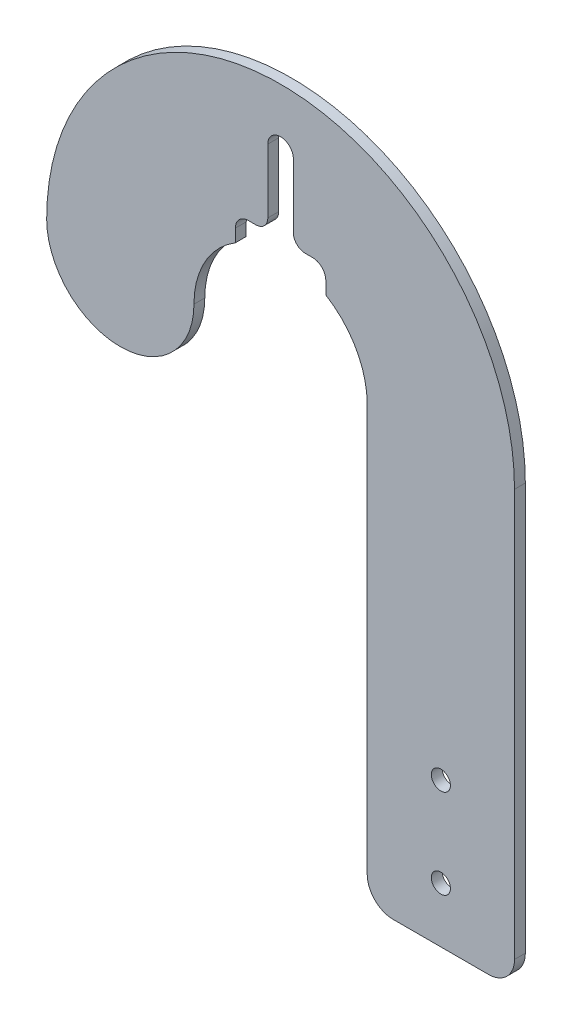
ISO-10303-21;
HEADER;
FILE_DESCRIPTION(('STEP AP214'),'2;1');
FILE_NAME('part.step','',(''),(''),'','','');
FILE_SCHEMA(('AUTOMOTIVE_DESIGN { 1 0 10303 214 1 1 1 1 }'));
ENDSEC;
DATA;
#1=APPLICATION_CONTEXT('core data for automotive mechanical design processes');
#2=APPLICATION_PROTOCOL_DEFINITION('international standard','automotive_design',2000,#1);
#3=PRODUCT_CONTEXT('',#1,'mechanical');
#4=PRODUCT('Part','Part','',(#3));
#5=PRODUCT_RELATED_PRODUCT_CATEGORY('part','',(#4));
#6=PRODUCT_DEFINITION_FORMATION('','',#4);
#7=PRODUCT_DEFINITION_CONTEXT('part definition',#1,'design');
#8=PRODUCT_DEFINITION('design','',#6,#7);
#9=PRODUCT_DEFINITION_SHAPE('','',#8);
#10=(LENGTH_UNIT() NAMED_UNIT(*) SI_UNIT(.MILLI.,.METRE.));
#11=(NAMED_UNIT(*) PLANE_ANGLE_UNIT() SI_UNIT($,.RADIAN.));
#12=(NAMED_UNIT(*) SI_UNIT($,.STERADIAN.) SOLID_ANGLE_UNIT());
#13=UNCERTAINTY_MEASURE_WITH_UNIT(LENGTH_MEASURE(1.E-05),#10,'distance_accuracy_value','');
#14=(GEOMETRIC_REPRESENTATION_CONTEXT(3) GLOBAL_UNCERTAINTY_ASSIGNED_CONTEXT((#13)) GLOBAL_UNIT_ASSIGNED_CONTEXT((#10,
#11,#12)) REPRESENTATION_CONTEXT('',''));
#15=CARTESIAN_POINT('',(0.,0.,0.));
#16=DIRECTION('',(0.,0.,1.));
#17=DIRECTION('',(1.,0.,0.));
#18=AXIS2_PLACEMENT_3D('',#15,#16,#17);
#19=CARTESIAN_POINT('',(-33.3556419332564,127.,-3.175));
#20=DIRECTION('',(0.,0.,-1.));
#21=DIRECTION('',(1.,0.,0.));
#22=AXIS2_PLACEMENT_3D('',#19,#20,#21);
#23=PLANE('',#22);
#24=CARTESIAN_POINT('',(13.6343580667436,16.2152888150637,-3.175));
#25=DIRECTION('',(0.,0.,1.));
#26=DIRECTION('',(1.,0.,0.));
#27=AXIS2_PLACEMENT_3D('',#24,#25,#26);
#28=CIRCLE('',#27,2.794);
#29=CARTESIAN_POINT('',(16.4283580667436,16.2152888150637,-3.175));
#30=VERTEX_POINT('',#29);
#31=EDGE_CURVE('E233',#30,#30,#28,.T.);
#32=ORIENTED_EDGE('',*,*,#31,.T.);
#33=EDGE_LOOP('',(#32));
#34=FACE_BOUND('',#33,.T.);
#35=CARTESIAN_POINT('',(13.6343580667436,42.3772888150637,-3.175));
#36=DIRECTION('',(0.,0.,1.));
#37=DIRECTION('',(1.,0.,0.));
#38=AXIS2_PLACEMENT_3D('',#35,#36,#37);
#39=CIRCLE('',#38,2.794);
#40=CARTESIAN_POINT('',(16.4283580667436,42.3772888150637,-3.175));
#41=VERTEX_POINT('',#40);
#42=EDGE_CURVE('E356',#41,#41,#39,.T.);
#43=ORIENTED_EDGE('',*,*,#42,.T.);
#44=EDGE_LOOP('',(#43));
#45=FACE_BOUND('',#44,.T.);
#46=DIRECTION('',(1.,0.,0.));
#47=VECTOR('',#46,1.);
#48=CARTESIAN_POINT('',(0.,156.225,-3.175));
#49=LINE('',#48,#47);
#50=CARTESIAN_POINT('',(-42.7806419332564,156.225,-3.175));
#51=VERTEX_POINT('',#50);
#52=CARTESIAN_POINT('',(-40.6056419332564,156.225,-3.175));
#53=VERTEX_POINT('',#52);
#54=EDGE_CURVE('E344',#51,#53,#49,.T.);
#55=ORIENTED_EDGE('',*,*,#54,.F.);
#56=CARTESIAN_POINT('',(-42.7806419332564,152.4,-3.175));
#57=DIRECTION('',(0.,0.,1.));
#58=DIRECTION('',(1.,0.,0.));
#59=AXIS2_PLACEMENT_3D('',#56,#57,#58);
#60=CIRCLE('',#59,3.825);
#61=CARTESIAN_POINT('',(-46.6056419332564,152.4,-3.175));
#62=VERTEX_POINT('',#61);
#63=EDGE_CURVE('E305',#62,#51,#60,.F.);
#64=ORIENTED_EDGE('',*,*,#63,.F.);
#65=DIRECTION('',(0.,1.,0.));
#66=VECTOR('',#65,1.);
#67=CARTESIAN_POINT('',(-46.6056419332564,0.,-3.175));
#68=LINE('',#67,#66);
#69=CARTESIAN_POINT('',(-46.6056419332564,148.670198430102,-3.175));
#70=VERTEX_POINT('',#69);
#71=EDGE_CURVE('E347',#70,#62,#68,.T.);
#72=ORIENTED_EDGE('',*,*,#71,.F.);
#73=CARTESIAN_POINT('',(-33.3556419332564,127.,-3.175));
#74=DIRECTION('',(0.,0.,-1.));
#75=DIRECTION('',(1.,0.,0.));
#76=AXIS2_PLACEMENT_3D('',#73,#74,#75);
#77=CIRCLE('',#76,25.4);
#78=CARTESIAN_POINT('',(-58.7556419332564,127.,-3.175));
#79=VERTEX_POINT('',#78);
#80=EDGE_CURVE('E206',#79,#70,#77,.T.);
#81=ORIENTED_EDGE('',*,*,#80,.F.);
#82=CARTESIAN_POINT('',(-80.3456419332564,127.,-3.175));
#83=DIRECTION('',(0.,0.,1.));
#84=DIRECTION('',(-1.,0.,0.));
#85=AXIS2_PLACEMENT_3D('',#82,#83,#84);
#86=CIRCLE('',#85,21.59);
#87=CARTESIAN_POINT('',(-101.935641933256,127.,-3.175));
#88=VERTEX_POINT('',#87);
#89=EDGE_CURVE('E207',#88,#79,#86,.T.);
#90=ORIENTED_EDGE('',*,*,#89,.F.);
#91=CARTESIAN_POINT('',(-33.3556419332564,127.,-3.175));
#92=DIRECTION('',(0.,0.,1.));
#93=DIRECTION('',(1.,0.,0.));
#94=AXIS2_PLACEMENT_3D('',#91,#92,#93);
#95=CIRCLE('',#94,68.58);
#96=CARTESIAN_POINT('',(35.2243580667436,127.,-3.175));
#97=VERTEX_POINT('',#96);
#98=EDGE_CURVE('E211',#97,#88,#95,.T.);
#99=ORIENTED_EDGE('',*,*,#98,.F.);
#100=DIRECTION('',(0.,1.,0.));
#101=VECTOR('',#100,1.);
#102=CARTESIAN_POINT('',(35.2243580667436,7.62,-3.175));
#103=LINE('',#102,#101);
#104=CARTESIAN_POINT('',(35.2243580667436,7.62,-3.175));
#105=VERTEX_POINT('',#104);
#106=EDGE_CURVE('E225',#105,#97,#103,.T.);
#107=ORIENTED_EDGE('',*,*,#106,.F.);
#108=CARTESIAN_POINT('',(27.6043580667436,7.62,-3.175));
#109=DIRECTION('',(0.,0.,1.));
#110=DIRECTION('',(1.,0.,0.));
#111=AXIS2_PLACEMENT_3D('',#108,#109,#110);
#112=CIRCLE('',#111,7.62);
#113=CARTESIAN_POINT('',(27.6043580667436,0.,-3.175));
#114=VERTEX_POINT('',#113);
#115=EDGE_CURVE('E222',#114,#105,#112,.T.);
#116=ORIENTED_EDGE('',*,*,#115,.F.);
#117=DIRECTION('',(1.,0.,0.));
#118=VECTOR('',#117,1.);
#119=CARTESIAN_POINT('',(-0.335641933256439,0.,-3.175));
#120=LINE('',#119,#118);
#121=CARTESIAN_POINT('',(-0.335641933256439,0.,-3.175));
#122=VERTEX_POINT('',#121);
#123=EDGE_CURVE('E219',#122,#114,#120,.T.);
#124=ORIENTED_EDGE('',*,*,#123,.F.);
#125=CARTESIAN_POINT('',(-0.335641933256439,7.62,-3.175));
#126=DIRECTION('',(0.,0.,1.));
#127=DIRECTION('',(-1.,0.,0.));
#128=AXIS2_PLACEMENT_3D('',#125,#126,#127);
#129=CIRCLE('',#128,7.62);
#130=CARTESIAN_POINT('',(-7.95564193325644,7.62,-3.175));
#131=VERTEX_POINT('',#130);
#132=EDGE_CURVE('E216',#131,#122,#129,.T.);
#133=ORIENTED_EDGE('',*,*,#132,.F.);
#134=DIRECTION('',(0.,-1.,0.));
#135=VECTOR('',#134,1.);
#136=CARTESIAN_POINT('',(-7.95564193325644,7.62,-3.175));
#137=LINE('',#136,#135);
#138=CARTESIAN_POINT('',(-7.95564193325644,127.,-3.175));
#139=VERTEX_POINT('',#138);
#140=EDGE_CURVE('E205',#139,#131,#137,.T.);
#141=ORIENTED_EDGE('',*,*,#140,.F.);
#142=CARTESIAN_POINT('',(-20.1056419332564,148.670198430102,-3.175));
#143=VERTEX_POINT('',#142);
#144=EDGE_CURVE('E182',#143,#139,#77,.T.);
#145=ORIENTED_EDGE('',*,*,#144,.F.);
#146=DIRECTION('',(0.,1.,0.));
#147=VECTOR('',#146,1.);
#148=CARTESIAN_POINT('',(-20.1056419332564,0.,-3.175));
#149=LINE('',#148,#147);
#150=CARTESIAN_POINT('',(-20.1056419332564,152.4,-3.175));
#151=VERTEX_POINT('',#150);
#152=EDGE_CURVE('E193',#143,#151,#149,.T.);
#153=ORIENTED_EDGE('',*,*,#152,.T.);
#154=CARTESIAN_POINT('',(-23.9306419332564,152.4,-3.175));
#155=DIRECTION('',(0.,0.,1.));
#156=DIRECTION('',(1.,0.,0.));
#157=AXIS2_PLACEMENT_3D('',#154,#155,#156);
#158=CIRCLE('',#157,3.825);
#159=CARTESIAN_POINT('',(-23.9306419332564,156.225,-3.175));
#160=VERTEX_POINT('',#159);
#161=EDGE_CURVE('E311',#160,#151,#158,.F.);
#162=ORIENTED_EDGE('',*,*,#161,.F.);
#163=DIRECTION('',(1.,0.,0.));
#164=VECTOR('',#163,1.);
#165=CARTESIAN_POINT('',(0.,156.225,-3.175));
#166=LINE('',#165,#164);
#167=CARTESIAN_POINT('',(-26.1056419332564,156.225,-3.175));
#168=VERTEX_POINT('',#167);
#169=EDGE_CURVE('E199',#168,#160,#166,.T.);
#170=ORIENTED_EDGE('',*,*,#169,.F.);
#171=CARTESIAN_POINT('',(-26.1056419332564,159.725,-3.175));
#172=DIRECTION('',(0.,0.,1.));
#173=DIRECTION('',(1.,0.,0.));
#174=AXIS2_PLACEMENT_3D('',#171,#172,#173);
#175=CIRCLE('',#174,3.5);
#176=CARTESIAN_POINT('',(-29.6056419332564,159.725,-3.175));
#177=VERTEX_POINT('',#176);
#178=EDGE_CURVE('E318',#177,#168,#175,.T.);
#179=ORIENTED_EDGE('',*,*,#178,.F.);
#180=DIRECTION('',(0.,-1.,0.));
#181=VECTOR('',#180,1.);
#182=CARTESIAN_POINT('',(-29.6056419332564,0.,-3.175));
#183=LINE('',#182,#181);
#184=CARTESIAN_POINT('',(-29.6056419332564,178.475,-3.175));
#185=VERTEX_POINT('',#184);
#186=EDGE_CURVE('E333',#185,#177,#183,.T.);
#187=ORIENTED_EDGE('',*,*,#186,.F.);
#188=CARTESIAN_POINT('',(-33.3556419332564,178.475,-3.175));
#189=DIRECTION('',(0.,0.,1.));
#190=DIRECTION('',(1.,0.,0.));
#191=AXIS2_PLACEMENT_3D('',#188,#189,#190);
#192=CIRCLE('',#191,3.75);
#193=CARTESIAN_POINT('',(-33.3556419332564,182.225,-3.175));
#194=VERTEX_POINT('',#193);
#195=EDGE_CURVE('E291',#194,#185,#192,.F.);
#196=ORIENTED_EDGE('',*,*,#195,.F.);
#197=CARTESIAN_POINT('',(-33.3556419332564,178.475,-3.175));
#198=DIRECTION('',(0.,0.,1.));
#199=DIRECTION('',(1.,0.,0.));
#200=AXIS2_PLACEMENT_3D('',#197,#198,#199);
#201=CIRCLE('',#200,3.75);
#202=CARTESIAN_POINT('',(-37.1056419332564,178.475,-3.175));
#203=VERTEX_POINT('',#202);
#204=EDGE_CURVE('E285',#203,#194,#201,.F.);
#205=ORIENTED_EDGE('',*,*,#204,.F.);
#206=DIRECTION('',(0.,-1.,0.));
#207=VECTOR('',#206,1.);
#208=CARTESIAN_POINT('',(-37.1056419332564,0.,-3.175));
#209=LINE('',#208,#207);
#210=CARTESIAN_POINT('',(-37.1056419332564,159.725,-3.175));
#211=VERTEX_POINT('',#210);
#212=EDGE_CURVE('E336',#203,#211,#209,.T.);
#213=ORIENTED_EDGE('',*,*,#212,.T.);
#214=CARTESIAN_POINT('',(-40.6056419332564,159.725,-3.175));
#215=DIRECTION('',(0.,0.,1.));
#216=DIRECTION('',(1.,0.,0.));
#217=AXIS2_PLACEMENT_3D('',#214,#215,#216);
#218=CIRCLE('',#217,3.5);
#219=EDGE_CURVE('E320',#53,#211,#218,.T.);
#220=ORIENTED_EDGE('',*,*,#219,.F.);
#221=EDGE_LOOP('',(#55,#64,#72,#81,#90,#99,#107,#116,#124,#133,#141,#145,#153,#162,#170,#179,
#187,#196,#205,#213,#220));
#222=FACE_BOUND('',#221,.T.);
#223=ADVANCED_FACE('F37',(#34,#45,#222),#23,.T.);
#224=CARTESIAN_POINT('',(-33.3556419332564,127.,0.));
#225=DIRECTION('',(0.,0.,-1.));
#226=DIRECTION('',(1.,0.,0.));
#227=AXIS2_PLACEMENT_3D('',#224,#225,#226);
#228=PLANE('',#227);
#229=CARTESIAN_POINT('',(13.6343580667436,42.3772888150637,0.));
#230=DIRECTION('',(0.,0.,1.));
#231=DIRECTION('',(1.,0.,0.));
#232=AXIS2_PLACEMENT_3D('',#229,#230,#231);
#233=CIRCLE('',#232,2.794);
#234=CARTESIAN_POINT('',(16.4283580667436,42.3772888150637,0.));
#235=VERTEX_POINT('',#234);
#236=EDGE_CURVE('E355',#235,#235,#233,.T.);
#237=ORIENTED_EDGE('',*,*,#236,.F.);
#238=EDGE_LOOP('',(#237));
#239=FACE_BOUND('',#238,.T.);
#240=CARTESIAN_POINT('',(13.6343580667436,16.2152888150637,0.));
#241=DIRECTION('',(0.,0.,1.));
#242=DIRECTION('',(1.,0.,0.));
#243=AXIS2_PLACEMENT_3D('',#240,#241,#242);
#244=CIRCLE('',#243,2.794);
#245=CARTESIAN_POINT('',(16.4283580667436,16.2152888150637,0.));
#246=VERTEX_POINT('',#245);
#247=EDGE_CURVE('E359',#246,#246,#244,.T.);
#248=ORIENTED_EDGE('',*,*,#247,.F.);
#249=EDGE_LOOP('',(#248));
#250=FACE_BOUND('',#249,.T.);
#251=DIRECTION('',(0.,-1.,0.));
#252=VECTOR('',#251,1.);
#253=CARTESIAN_POINT('',(-37.1056419332564,127.,0.));
#254=LINE('',#253,#252);
#255=CARTESIAN_POINT('',(-37.1056419332564,178.475,0.));
#256=VERTEX_POINT('',#255);
#257=CARTESIAN_POINT('',(-37.1056419332564,159.725,0.));
#258=VERTEX_POINT('',#257);
#259=EDGE_CURVE('E275',#256,#258,#254,.T.);
#260=ORIENTED_EDGE('',*,*,#259,.F.);
#261=CARTESIAN_POINT('',(-33.3556419332564,178.475,0.));
#262=DIRECTION('',(0.,0.,1.));
#263=DIRECTION('',(1.,0.,0.));
#264=AXIS2_PLACEMENT_3D('',#261,#262,#263);
#265=CIRCLE('',#264,3.75);
#266=CARTESIAN_POINT('',(-33.3556419332564,182.225,0.));
#267=VERTEX_POINT('',#266);
#268=EDGE_CURVE('E288',#267,#256,#265,.T.);
#269=ORIENTED_EDGE('',*,*,#268,.F.);
#270=CARTESIAN_POINT('',(-33.3556419332564,178.475,0.));
#271=DIRECTION('',(0.,0.,1.));
#272=DIRECTION('',(1.,0.,0.));
#273=AXIS2_PLACEMENT_3D('',#270,#271,#272);
#274=CIRCLE('',#273,3.75);
#275=CARTESIAN_POINT('',(-29.6056419332564,178.475,0.));
#276=VERTEX_POINT('',#275);
#277=EDGE_CURVE('E294',#276,#267,#274,.T.);
#278=ORIENTED_EDGE('',*,*,#277,.F.);
#279=DIRECTION('',(0.,-1.,0.));
#280=VECTOR('',#279,1.);
#281=CARTESIAN_POINT('',(-29.6056419332564,127.,0.));
#282=LINE('',#281,#280);
#283=CARTESIAN_POINT('',(-29.6056419332564,159.725,0.));
#284=VERTEX_POINT('',#283);
#285=EDGE_CURVE('E272',#276,#284,#282,.T.);
#286=ORIENTED_EDGE('',*,*,#285,.T.);
#287=CARTESIAN_POINT('',(-26.1056419332564,159.725,0.));
#288=DIRECTION('',(0.,0.,1.));
#289=DIRECTION('',(1.,0.,0.));
#290=AXIS2_PLACEMENT_3D('',#287,#288,#289);
#291=CIRCLE('',#290,3.5);
#292=CARTESIAN_POINT('',(-26.1056419332564,156.225,0.));
#293=VERTEX_POINT('',#292);
#294=EDGE_CURVE('E325',#293,#284,#291,.F.);
#295=ORIENTED_EDGE('',*,*,#294,.F.);
#296=DIRECTION('',(1.,0.,0.));
#297=VECTOR('',#296,1.);
#298=CARTESIAN_POINT('',(-33.3556419332564,156.225,0.));
#299=LINE('',#298,#297);
#300=CARTESIAN_POINT('',(-23.9306419332564,156.225,0.));
#301=VERTEX_POINT('',#300);
#302=EDGE_CURVE('E269',#293,#301,#299,.T.);
#303=ORIENTED_EDGE('',*,*,#302,.T.);
#304=CARTESIAN_POINT('',(-23.9306419332564,152.4,0.));
#305=DIRECTION('',(0.,0.,1.));
#306=DIRECTION('',(1.,0.,0.));
#307=AXIS2_PLACEMENT_3D('',#304,#305,#306);
#308=CIRCLE('',#307,3.825);
#309=CARTESIAN_POINT('',(-20.1056419332564,152.4,0.));
#310=VERTEX_POINT('',#309);
#311=EDGE_CURVE('E313',#310,#301,#308,.T.);
#312=ORIENTED_EDGE('',*,*,#311,.F.);
#313=DIRECTION('',(0.,1.,0.));
#314=VECTOR('',#313,1.);
#315=CARTESIAN_POINT('',(-20.1056419332564,127.,0.));
#316=LINE('',#315,#314);
#317=CARTESIAN_POINT('',(-20.1056419332564,148.670198430102,0.));
#318=VERTEX_POINT('',#317);
#319=EDGE_CURVE('E350',#318,#310,#316,.T.);
#320=ORIENTED_EDGE('',*,*,#319,.F.);
#321=CARTESIAN_POINT('',(-33.3556419332564,127.,0.));
#322=DIRECTION('',(0.,0.,-1.));
#323=DIRECTION('',(1.,0.,0.));
#324=AXIS2_PLACEMENT_3D('',#321,#322,#323);
#325=CIRCLE('',#324,25.4);
#326=CARTESIAN_POINT('',(-7.95564193325644,127.,0.));
#327=VERTEX_POINT('',#326);
#328=EDGE_CURVE('E185',#318,#327,#325,.T.);
#329=ORIENTED_EDGE('',*,*,#328,.T.);
#330=DIRECTION('',(0.,-1.,0.));
#331=VECTOR('',#330,1.);
#332=CARTESIAN_POINT('',(-7.95564193325644,7.62,0.));
#333=LINE('',#332,#331);
#334=CARTESIAN_POINT('',(-7.95564193325644,7.62,0.));
#335=VERTEX_POINT('',#334);
#336=EDGE_CURVE('E239',#327,#335,#333,.T.);
#337=ORIENTED_EDGE('',*,*,#336,.T.);
#338=CARTESIAN_POINT('',(-0.335641933256439,7.62,0.));
#339=DIRECTION('',(0.,0.,1.));
#340=DIRECTION('',(-1.,0.,0.));
#341=AXIS2_PLACEMENT_3D('',#338,#339,#340);
#342=CIRCLE('',#341,7.62);
#343=CARTESIAN_POINT('',(-0.335641933256439,0.,0.));
#344=VERTEX_POINT('',#343);
#345=EDGE_CURVE('E242',#335,#344,#342,.T.);
#346=ORIENTED_EDGE('',*,*,#345,.T.);
#347=DIRECTION('',(1.,0.,0.));
#348=VECTOR('',#347,1.);
#349=CARTESIAN_POINT('',(-0.335641933256439,0.,0.));
#350=LINE('',#349,#348);
#351=CARTESIAN_POINT('',(27.6043580667436,0.,0.));
#352=VERTEX_POINT('',#351);
#353=EDGE_CURVE('E245',#344,#352,#350,.T.);
#354=ORIENTED_EDGE('',*,*,#353,.T.);
#355=CARTESIAN_POINT('',(27.6043580667436,7.62,0.));
#356=DIRECTION('',(0.,0.,1.));
#357=DIRECTION('',(1.,0.,0.));
#358=AXIS2_PLACEMENT_3D('',#355,#356,#357);
#359=CIRCLE('',#358,7.62);
#360=CARTESIAN_POINT('',(35.2243580667436,7.62,0.));
#361=VERTEX_POINT('',#360);
#362=EDGE_CURVE('E248',#352,#361,#359,.T.);
#363=ORIENTED_EDGE('',*,*,#362,.T.);
#364=DIRECTION('',(0.,1.,0.));
#365=VECTOR('',#364,1.);
#366=CARTESIAN_POINT('',(35.2243580667436,7.62,0.));
#367=LINE('',#366,#365);
#368=CARTESIAN_POINT('',(35.2243580667436,127.,0.));
#369=VERTEX_POINT('',#368);
#370=EDGE_CURVE('E251',#361,#369,#367,.T.);
#371=ORIENTED_EDGE('',*,*,#370,.T.);
#372=CARTESIAN_POINT('',(-33.3556419332564,127.,0.));
#373=DIRECTION('',(0.,0.,1.));
#374=DIRECTION('',(1.,0.,0.));
#375=AXIS2_PLACEMENT_3D('',#372,#373,#374);
#376=CIRCLE('',#375,68.58);
#377=CARTESIAN_POINT('',(-101.935641933256,127.,0.));
#378=VERTEX_POINT('',#377);
#379=EDGE_CURVE('E229',#369,#378,#376,.T.);
#380=ORIENTED_EDGE('',*,*,#379,.T.);
#381=CARTESIAN_POINT('',(-80.3456419332564,127.,0.));
#382=DIRECTION('',(0.,0.,1.));
#383=DIRECTION('',(-1.,0.,0.));
#384=AXIS2_PLACEMENT_3D('',#381,#382,#383);
#385=CIRCLE('',#384,21.59);
#386=CARTESIAN_POINT('',(-58.7556419332564,127.,0.));
#387=VERTEX_POINT('',#386);
#388=EDGE_CURVE('E232',#378,#387,#385,.T.);
#389=ORIENTED_EDGE('',*,*,#388,.T.);
#390=CARTESIAN_POINT('',(-46.6056419332564,148.670198430102,0.));
#391=VERTEX_POINT('',#390);
#392=EDGE_CURVE('E236',#387,#391,#325,.T.);
#393=ORIENTED_EDGE('',*,*,#392,.T.);
#394=DIRECTION('',(0.,1.,0.));
#395=VECTOR('',#394,1.);
#396=CARTESIAN_POINT('',(-46.6056419332564,127.,0.));
#397=LINE('',#396,#395);
#398=CARTESIAN_POINT('',(-46.6056419332564,152.4,0.));
#399=VERTEX_POINT('',#398);
#400=EDGE_CURVE('E352',#391,#399,#397,.T.);
#401=ORIENTED_EDGE('',*,*,#400,.T.);
#402=CARTESIAN_POINT('',(-42.7806419332564,152.4,0.));
#403=DIRECTION('',(0.,0.,1.));
#404=DIRECTION('',(1.,0.,0.));
#405=AXIS2_PLACEMENT_3D('',#402,#403,#404);
#406=CIRCLE('',#405,3.825);
#407=CARTESIAN_POINT('',(-42.7806419332564,156.225,0.));
#408=VERTEX_POINT('',#407);
#409=EDGE_CURVE('E308',#408,#399,#406,.T.);
#410=ORIENTED_EDGE('',*,*,#409,.F.);
#411=DIRECTION('',(1.,0.,0.));
#412=VECTOR('',#411,1.);
#413=CARTESIAN_POINT('',(-33.3556419332564,156.225,0.));
#414=LINE('',#413,#412);
#415=CARTESIAN_POINT('',(-40.6056419332564,156.225,0.));
#416=VERTEX_POINT('',#415);
#417=EDGE_CURVE('E278',#408,#416,#414,.T.);
#418=ORIENTED_EDGE('',*,*,#417,.T.);
#419=CARTESIAN_POINT('',(-40.6056419332564,159.725,0.));
#420=DIRECTION('',(0.,0.,1.));
#421=DIRECTION('',(1.,0.,0.));
#422=AXIS2_PLACEMENT_3D('',#419,#420,#421);
#423=CIRCLE('',#422,3.5);
#424=EDGE_CURVE('E327',#258,#416,#423,.F.);
#425=ORIENTED_EDGE('',*,*,#424,.F.);
#426=EDGE_LOOP('',(#260,#269,#278,#286,#295,#303,#312,#320,#329,#337,#346,#354,#363,#371,#380,
#389,#393,#401,#410,#418,#425));
#427=FACE_BOUND('',#426,.T.);
#428=ADVANCED_FACE('F380',(#239,#250,#427),#228,.F.);
#429=CARTESIAN_POINT('',(-33.3556419332564,127.,-3.175));
#430=DIRECTION('',(0.,0.,1.));
#431=DIRECTION('',(-1.,0.,0.));
#432=AXIS2_PLACEMENT_3D('',#429,#430,#431);
#433=CYLINDRICAL_SURFACE('',#432,25.4);
#434=DIRECTION('',(0.,0.,1.));
#435=VECTOR('',#434,1.);
#436=CARTESIAN_POINT('',(-46.6056419332564,148.670198430102,-3.175));
#437=LINE('',#436,#435);
#438=EDGE_CURVE('E189',#70,#391,#437,.T.);
#439=ORIENTED_EDGE('',*,*,#438,.T.);
#440=ORIENTED_EDGE('',*,*,#392,.F.);
#441=DIRECTION('',(0.,0.,1.));
#442=VECTOR('',#441,1.);
#443=CARTESIAN_POINT('',(-58.7556419332564,127.,-3.175));
#444=LINE('',#443,#442);
#445=EDGE_CURVE('E265',#79,#387,#444,.T.);
#446=ORIENTED_EDGE('',*,*,#445,.F.);
#447=ORIENTED_EDGE('',*,*,#80,.T.);
#448=EDGE_LOOP('',(#439,#440,#446,#447));
#449=FACE_BOUND('',#448,.T.);
#450=ADVANCED_FACE('F427',(#449),#433,.F.);
#451=CARTESIAN_POINT('',(-33.3556419332564,127.,-3.175));
#452=DIRECTION('',(0.,0.,1.));
#453=DIRECTION('',(-1.,0.,0.));
#454=AXIS2_PLACEMENT_3D('',#451,#452,#453);
#455=CYLINDRICAL_SURFACE('',#454,68.58);
#456=ORIENTED_EDGE('',*,*,#379,.F.);
#457=DIRECTION('',(0.,0.,1.));
#458=VECTOR('',#457,1.);
#459=CARTESIAN_POINT('',(35.2243580667436,127.,-3.175));
#460=LINE('',#459,#458);
#461=EDGE_CURVE('E228',#97,#369,#460,.T.);
#462=ORIENTED_EDGE('',*,*,#461,.F.);
#463=ORIENTED_EDGE('',*,*,#98,.T.);
#464=DIRECTION('',(0.,0.,1.));
#465=VECTOR('',#464,1.);
#466=CARTESIAN_POINT('',(-101.935641933256,127.,-3.175));
#467=LINE('',#466,#465);
#468=EDGE_CURVE('E190',#88,#378,#467,.T.);
#469=ORIENTED_EDGE('',*,*,#468,.T.);
#470=EDGE_LOOP('',(#456,#462,#463,#469));
#471=FACE_BOUND('',#470,.T.);
#472=ADVANCED_FACE('F370',(#471),#455,.T.);
#473=CARTESIAN_POINT('',(-80.3456419332564,127.,-3.175));
#474=DIRECTION('',(0.,0.,1.));
#475=DIRECTION('',(-1.,0.,0.));
#476=AXIS2_PLACEMENT_3D('',#473,#474,#475);
#477=CYLINDRICAL_SURFACE('',#476,21.59);
#478=ORIENTED_EDGE('',*,*,#388,.F.);
#479=ORIENTED_EDGE('',*,*,#468,.F.);
#480=ORIENTED_EDGE('',*,*,#89,.T.);
#481=ORIENTED_EDGE('',*,*,#445,.T.);
#482=EDGE_LOOP('',(#478,#479,#480,#481));
#483=FACE_BOUND('',#482,.T.);
#484=ADVANCED_FACE('F376',(#483),#477,.T.);
#485=ORIENTED_EDGE('',*,*,#144,.T.);
#486=DIRECTION('',(0.,0.,1.));
#487=VECTOR('',#486,1.);
#488=CARTESIAN_POINT('',(-7.95564193325644,127.,-3.175));
#489=LINE('',#488,#487);
#490=EDGE_CURVE('E263',#139,#327,#489,.T.);
#491=ORIENTED_EDGE('',*,*,#490,.T.);
#492=ORIENTED_EDGE('',*,*,#328,.F.);
#493=DIRECTION('',(0.,0.,1.));
#494=VECTOR('',#493,1.);
#495=CARTESIAN_POINT('',(-20.1056419332564,148.670198430102,-3.175));
#496=LINE('',#495,#494);
#497=EDGE_CURVE('E178',#143,#318,#496,.T.);
#498=ORIENTED_EDGE('',*,*,#497,.F.);
#499=EDGE_LOOP('',(#485,#491,#492,#498));
#500=FACE_BOUND('',#499,.T.);
#501=ADVANCED_FACE('F180',(#500),#433,.F.);
#502=CARTESIAN_POINT('',(-7.95564193325644,7.62,-3.175));
#503=DIRECTION('',(1.,0.,0.));
#504=DIRECTION('',(0.,1.,0.));
#505=AXIS2_PLACEMENT_3D('',#502,#503,#504);
#506=PLANE('',#505);
#507=ORIENTED_EDGE('',*,*,#336,.F.);
#508=ORIENTED_EDGE('',*,*,#490,.F.);
#509=ORIENTED_EDGE('',*,*,#140,.T.);
#510=DIRECTION('',(0.,0.,1.));
#511=VECTOR('',#510,1.);
#512=CARTESIAN_POINT('',(-7.95564193325644,7.62,-3.175));
#513=LINE('',#512,#511);
#514=EDGE_CURVE('E261',#131,#335,#513,.T.);
#515=ORIENTED_EDGE('',*,*,#514,.T.);
#516=EDGE_LOOP('',(#507,#508,#509,#515));
#517=FACE_BOUND('',#516,.T.);
#518=ADVANCED_FACE('F397',(#517),#506,.F.);
#519=CARTESIAN_POINT('',(-0.335641933256439,7.62,-3.175));
#520=DIRECTION('',(0.,0.,1.));
#521=DIRECTION('',(-1.,0.,0.));
#522=AXIS2_PLACEMENT_3D('',#519,#520,#521);
#523=CYLINDRICAL_SURFACE('',#522,7.62);
#524=ORIENTED_EDGE('',*,*,#345,.F.);
#525=ORIENTED_EDGE('',*,*,#514,.F.);
#526=ORIENTED_EDGE('',*,*,#132,.T.);
#527=DIRECTION('',(0.,0.,1.));
#528=VECTOR('',#527,1.);
#529=CARTESIAN_POINT('',(-0.335641933256439,0.,-3.175));
#530=LINE('',#529,#528);
#531=EDGE_CURVE('E259',#122,#344,#530,.T.);
#532=ORIENTED_EDGE('',*,*,#531,.T.);
#533=EDGE_LOOP('',(#524,#525,#526,#532));
#534=FACE_BOUND('',#533,.T.);
#535=ADVANCED_FACE('F394',(#534),#523,.T.);
#536=CARTESIAN_POINT('',(-0.335641933256439,0.,-3.175));
#537=DIRECTION('',(0.,1.,0.));
#538=DIRECTION('',(0.,0.,-1.));
#539=AXIS2_PLACEMENT_3D('',#536,#537,#538);
#540=PLANE('',#539);
#541=ORIENTED_EDGE('',*,*,#353,.F.);
#542=ORIENTED_EDGE('',*,*,#531,.F.);
#543=ORIENTED_EDGE('',*,*,#123,.T.);
#544=DIRECTION('',(0.,0.,1.));
#545=VECTOR('',#544,1.);
#546=CARTESIAN_POINT('',(27.6043580667436,0.,-3.175));
#547=LINE('',#546,#545);
#548=EDGE_CURVE('E257',#114,#352,#547,.T.);
#549=ORIENTED_EDGE('',*,*,#548,.T.);
#550=EDGE_LOOP('',(#541,#542,#543,#549));
#551=FACE_BOUND('',#550,.T.);
#552=ADVANCED_FACE('F391',(#551),#540,.F.);
#553=CARTESIAN_POINT('',(27.6043580667436,7.62,-3.175));
#554=DIRECTION('',(0.,0.,1.));
#555=DIRECTION('',(-1.,0.,0.));
#556=AXIS2_PLACEMENT_3D('',#553,#554,#555);
#557=CYLINDRICAL_SURFACE('',#556,7.62);
#558=ORIENTED_EDGE('',*,*,#362,.F.);
#559=ORIENTED_EDGE('',*,*,#548,.F.);
#560=ORIENTED_EDGE('',*,*,#115,.T.);
#561=DIRECTION('',(0.,0.,1.));
#562=VECTOR('',#561,1.);
#563=CARTESIAN_POINT('',(35.2243580667436,7.62,-3.175));
#564=LINE('',#563,#562);
#565=EDGE_CURVE('E255',#105,#361,#564,.T.);
#566=ORIENTED_EDGE('',*,*,#565,.T.);
#567=EDGE_LOOP('',(#558,#559,#560,#566));
#568=FACE_BOUND('',#567,.T.);
#569=ADVANCED_FACE('F388',(#568),#557,.T.);
#570=CARTESIAN_POINT('',(35.2243580667436,7.62,-3.175));
#571=DIRECTION('',(-1.,0.,0.));
#572=DIRECTION('',(0.,-1.,0.));
#573=AXIS2_PLACEMENT_3D('',#570,#571,#572);
#574=PLANE('',#573);
#575=ORIENTED_EDGE('',*,*,#370,.F.);
#576=ORIENTED_EDGE('',*,*,#565,.F.);
#577=ORIENTED_EDGE('',*,*,#106,.T.);
#578=ORIENTED_EDGE('',*,*,#461,.T.);
#579=EDGE_LOOP('',(#575,#576,#577,#578));
#580=FACE_BOUND('',#579,.T.);
#581=ADVANCED_FACE('F384',(#580),#574,.F.);
#582=CARTESIAN_POINT('',(13.6343580667436,16.2152888150637,-3.175));
#583=DIRECTION('',(0.,0.,1.));
#584=DIRECTION('',(-1.,0.,0.));
#585=AXIS2_PLACEMENT_3D('',#582,#583,#584);
#586=CYLINDRICAL_SURFACE('',#585,2.794);
#587=ORIENTED_EDGE('',*,*,#31,.F.);
#588=EDGE_LOOP('',(#587));
#589=FACE_BOUND('',#588,.T.);
#590=ORIENTED_EDGE('',*,*,#247,.T.);
#591=EDGE_LOOP('',(#590));
#592=FACE_BOUND('',#591,.T.);
#593=ADVANCED_FACE('F447',(#589,#592),#586,.F.);
#594=CARTESIAN_POINT('',(13.6343580667436,42.3772888150637,-3.175));
#595=DIRECTION('',(0.,0.,1.));
#596=DIRECTION('',(-1.,0.,0.));
#597=AXIS2_PLACEMENT_3D('',#594,#595,#596);
#598=CYLINDRICAL_SURFACE('',#597,2.794);
#599=ORIENTED_EDGE('',*,*,#42,.F.);
#600=EDGE_LOOP('',(#599));
#601=FACE_BOUND('',#600,.T.);
#602=ORIENTED_EDGE('',*,*,#236,.T.);
#603=EDGE_LOOP('',(#602));
#604=FACE_BOUND('',#603,.T.);
#605=ADVANCED_FACE('F485',(#601,#604),#598,.F.);
#606=CARTESIAN_POINT('',(0.,156.225,6.825));
#607=DIRECTION('',(0.,-1.,0.));
#608=DIRECTION('',(0.,0.,1.));
#609=AXIS2_PLACEMENT_3D('',#606,#607,#608);
#610=PLANE('',#609);
#611=ORIENTED_EDGE('',*,*,#417,.F.);
#612=DIRECTION('',(0.,0.,-1.));
#613=VECTOR('',#612,1.);
#614=CARTESIAN_POINT('',(-42.7806419332564,156.225,0.));
#615=LINE('',#614,#613);
#616=EDGE_CURVE('E300',#51,#408,#615,.F.);
#617=ORIENTED_EDGE('',*,*,#616,.F.);
#618=ORIENTED_EDGE('',*,*,#54,.T.);
#619=DIRECTION('',(0.,0.,-1.));
#620=VECTOR('',#619,1.);
#621=CARTESIAN_POINT('',(-40.6056419332564,156.225,-3.175));
#622=LINE('',#621,#620);
#623=EDGE_CURVE('E316',#416,#53,#622,.T.);
#624=ORIENTED_EDGE('',*,*,#623,.F.);
#625=EDGE_LOOP('',(#611,#617,#618,#624));
#626=FACE_BOUND('',#625,.T.);
#627=ADVANCED_FACE('F419',(#626),#610,.T.);
#628=CARTESIAN_POINT('',(-37.1056419332564,0.,6.825));
#629=DIRECTION('',(-1.,0.,0.));
#630=DIRECTION('',(0.,-1.,0.));
#631=AXIS2_PLACEMENT_3D('',#628,#629,#630);
#632=PLANE('',#631);
#633=ORIENTED_EDGE('',*,*,#212,.F.);
#634=DIRECTION('',(0.,0.,-1.));
#635=VECTOR('',#634,1.);
#636=CARTESIAN_POINT('',(-37.1056419332564,178.475,6.825));
#637=LINE('',#636,#635);
#638=EDGE_CURVE('E281',#256,#203,#637,.T.);
#639=ORIENTED_EDGE('',*,*,#638,.F.);
#640=ORIENTED_EDGE('',*,*,#259,.T.);
#641=DIRECTION('',(0.,0.,-1.));
#642=VECTOR('',#641,1.);
#643=CARTESIAN_POINT('',(-37.1056419332564,159.725,0.));
#644=LINE('',#643,#642);
#645=EDGE_CURVE('E323',#211,#258,#644,.F.);
#646=ORIENTED_EDGE('',*,*,#645,.F.);
#647=EDGE_LOOP('',(#633,#639,#640,#646));
#648=FACE_BOUND('',#647,.T.);
#649=ADVANCED_FACE('F412',(#648),#632,.F.);
#650=CARTESIAN_POINT('',(-29.6056419332564,0.,6.825));
#651=DIRECTION('',(-1.,0.,0.));
#652=DIRECTION('',(0.,-1.,0.));
#653=AXIS2_PLACEMENT_3D('',#650,#651,#652);
#654=PLANE('',#653);
#655=ORIENTED_EDGE('',*,*,#285,.F.);
#656=DIRECTION('',(0.,0.,-1.));
#657=VECTOR('',#656,1.);
#658=CARTESIAN_POINT('',(-29.6056419332564,178.475,0.));
#659=LINE('',#658,#657);
#660=EDGE_CURVE('E283',#185,#276,#659,.F.);
#661=ORIENTED_EDGE('',*,*,#660,.F.);
#662=ORIENTED_EDGE('',*,*,#186,.T.);
#663=DIRECTION('',(0.,0.,-1.));
#664=VECTOR('',#663,1.);
#665=CARTESIAN_POINT('',(-29.6056419332564,159.725,6.825));
#666=LINE('',#665,#664);
#667=EDGE_CURVE('E45',#284,#177,#666,.T.);
#668=ORIENTED_EDGE('',*,*,#667,.F.);
#669=EDGE_LOOP('',(#655,#661,#662,#668));
#670=FACE_BOUND('',#669,.T.);
#671=ADVANCED_FACE('F334',(#670),#654,.T.);
#672=CARTESIAN_POINT('',(0.,156.225,6.825));
#673=DIRECTION('',(0.,-1.,0.));
#674=DIRECTION('',(0.,0.,1.));
#675=AXIS2_PLACEMENT_3D('',#672,#673,#674);
#676=PLANE('',#675);
#677=ORIENTED_EDGE('',*,*,#169,.T.);
#678=DIRECTION('',(0.,0.,-1.));
#679=VECTOR('',#678,1.);
#680=CARTESIAN_POINT('',(-23.9306419332564,156.225,6.825));
#681=LINE('',#680,#679);
#682=EDGE_CURVE('E302',#301,#160,#681,.T.);
#683=ORIENTED_EDGE('',*,*,#682,.F.);
#684=ORIENTED_EDGE('',*,*,#302,.F.);
#685=DIRECTION('',(0.,0.,-1.));
#686=VECTOR('',#685,1.);
#687=CARTESIAN_POINT('',(-26.1056419332564,156.225,6.825));
#688=LINE('',#687,#686);
#689=EDGE_CURVE('E11',#168,#293,#688,.F.);
#690=ORIENTED_EDGE('',*,*,#689,.F.);
#691=EDGE_LOOP('',(#677,#683,#684,#690));
#692=FACE_BOUND('',#691,.T.);
#693=ADVANCED_FACE('F401',(#692),#676,.T.);
#694=CARTESIAN_POINT('',(-46.6056419332564,0.,6.825));
#695=DIRECTION('',(1.,0.,0.));
#696=DIRECTION('',(0.,0.,1.));
#697=AXIS2_PLACEMENT_3D('',#694,#695,#696);
#698=PLANE('',#697);
#699=ORIENTED_EDGE('',*,*,#400,.F.);
#700=ORIENTED_EDGE('',*,*,#438,.F.);
#701=ORIENTED_EDGE('',*,*,#71,.T.);
#702=DIRECTION('',(0.,0.,-1.));
#703=VECTOR('',#702,1.);
#704=CARTESIAN_POINT('',(-46.6056419332564,152.4,-3.175));
#705=LINE('',#704,#703);
#706=EDGE_CURVE('E297',#399,#62,#705,.T.);
#707=ORIENTED_EDGE('',*,*,#706,.F.);
#708=EDGE_LOOP('',(#699,#700,#701,#707));
#709=FACE_BOUND('',#708,.T.);
#710=ADVANCED_FACE('F425',(#709),#698,.T.);
#711=CARTESIAN_POINT('',(-20.1056419332564,0.,6.825));
#712=DIRECTION('',(1.,0.,0.));
#713=DIRECTION('',(0.,0.,1.));
#714=AXIS2_PLACEMENT_3D('',#711,#712,#713);
#715=PLANE('',#714);
#716=ORIENTED_EDGE('',*,*,#152,.F.);
#717=ORIENTED_EDGE('',*,*,#497,.T.);
#718=ORIENTED_EDGE('',*,*,#319,.T.);
#719=DIRECTION('',(0.,0.,-1.));
#720=VECTOR('',#719,1.);
#721=CARTESIAN_POINT('',(-20.1056419332564,152.4,6.825));
#722=LINE('',#721,#720);
#723=EDGE_CURVE('E195',#151,#310,#722,.F.);
#724=ORIENTED_EDGE('',*,*,#723,.F.);
#725=EDGE_LOOP('',(#716,#717,#718,#724));
#726=FACE_BOUND('',#725,.T.);
#727=ADVANCED_FACE('F194',(#726),#715,.F.);
#728=CARTESIAN_POINT('',(-33.3556419332564,178.475,6.825));
#729=DIRECTION('',(0.,0.,1.));
#730=DIRECTION('',(-1.,0.,0.));
#731=AXIS2_PLACEMENT_3D('',#728,#729,#730);
#732=CYLINDRICAL_SURFACE('',#731,3.75);
#733=DIRECTION('',(0.,0.,-1.));
#734=VECTOR('',#733,1.);
#735=CARTESIAN_POINT('',(-33.3556419332564,182.225,-3.175));
#736=LINE('',#735,#734);
#737=EDGE_CURVE('E200',#267,#194,#736,.T.);
#738=ORIENTED_EDGE('',*,*,#737,.T.);
#739=ORIENTED_EDGE('',*,*,#195,.T.);
#740=ORIENTED_EDGE('',*,*,#660,.T.);
#741=ORIENTED_EDGE('',*,*,#277,.T.);
#742=EDGE_LOOP('',(#738,#739,#740,#741));
#743=FACE_BOUND('',#742,.T.);
#744=ADVANCED_FACE('F405',(#743),#732,.F.);
#745=CARTESIAN_POINT('',(-33.3556419332564,178.475,6.825));
#746=DIRECTION('',(0.,0.,-1.));
#747=DIRECTION('',(1.,0.,0.));
#748=AXIS2_PLACEMENT_3D('',#745,#746,#747);
#749=CYLINDRICAL_SURFACE('',#748,3.75);
#750=ORIENTED_EDGE('',*,*,#268,.T.);
#751=ORIENTED_EDGE('',*,*,#638,.T.);
#752=ORIENTED_EDGE('',*,*,#204,.T.);
#753=ORIENTED_EDGE('',*,*,#737,.F.);
#754=EDGE_LOOP('',(#750,#751,#752,#753));
#755=FACE_BOUND('',#754,.T.);
#756=ADVANCED_FACE('F410',(#755),#749,.F.);
#757=CARTESIAN_POINT('',(-42.7806419332564,152.4,6.825));
#758=DIRECTION('',(0.,0.,1.));
#759=DIRECTION('',(-1.,0.,0.));
#760=AXIS2_PLACEMENT_3D('',#757,#758,#759);
#761=CYLINDRICAL_SURFACE('',#760,3.825);
#762=ORIENTED_EDGE('',*,*,#409,.T.);
#763=ORIENTED_EDGE('',*,*,#706,.T.);
#764=ORIENTED_EDGE('',*,*,#63,.T.);
#765=ORIENTED_EDGE('',*,*,#616,.T.);
#766=EDGE_LOOP('',(#762,#763,#764,#765));
#767=FACE_BOUND('',#766,.T.);
#768=ADVANCED_FACE('F422',(#767),#761,.F.);
#769=CARTESIAN_POINT('',(-23.9306419332564,152.4,6.825));
#770=DIRECTION('',(0.,0.,-1.));
#771=DIRECTION('',(1.,0.,0.));
#772=AXIS2_PLACEMENT_3D('',#769,#770,#771);
#773=CYLINDRICAL_SURFACE('',#772,3.825);
#774=ORIENTED_EDGE('',*,*,#311,.T.);
#775=ORIENTED_EDGE('',*,*,#682,.T.);
#776=ORIENTED_EDGE('',*,*,#161,.T.);
#777=ORIENTED_EDGE('',*,*,#723,.T.);
#778=EDGE_LOOP('',(#774,#775,#776,#777));
#779=FACE_BOUND('',#778,.T.);
#780=ADVANCED_FACE('F400',(#779),#773,.F.);
#781=CARTESIAN_POINT('',(-40.6056419332564,159.725,6.825));
#782=DIRECTION('',(0.,0.,1.));
#783=DIRECTION('',(-1.,0.,0.));
#784=AXIS2_PLACEMENT_3D('',#781,#782,#783);
#785=CYLINDRICAL_SURFACE('',#784,3.5);
#786=ORIENTED_EDGE('',*,*,#424,.T.);
#787=ORIENTED_EDGE('',*,*,#623,.T.);
#788=ORIENTED_EDGE('',*,*,#219,.T.);
#789=ORIENTED_EDGE('',*,*,#645,.T.);
#790=EDGE_LOOP('',(#786,#787,#788,#789));
#791=FACE_BOUND('',#790,.T.);
#792=ADVANCED_FACE('F415',(#791),#785,.T.);
#793=CARTESIAN_POINT('',(-26.1056419332564,159.725,6.825));
#794=DIRECTION('',(0.,0.,-1.));
#795=DIRECTION('',(1.,0.,0.));
#796=AXIS2_PLACEMENT_3D('',#793,#794,#795);
#797=CYLINDRICAL_SURFACE('',#796,3.5);
#798=ORIENTED_EDGE('',*,*,#294,.T.);
#799=ORIENTED_EDGE('',*,*,#667,.T.);
#800=ORIENTED_EDGE('',*,*,#178,.T.);
#801=ORIENTED_EDGE('',*,*,#689,.T.);
#802=EDGE_LOOP('',(#798,#799,#800,#801));
#803=FACE_BOUND('',#802,.T.);
#804=ADVANCED_FACE('F39',(#803),#797,.T.);
#805=CLOSED_SHELL('',(#223,#428,#450,#472,#484,#501,#518,#535,#552,#569,#581,#593,#605,#627,
#649,#671,#693,#710,#727,#744,#756,#768,#780,#792,#804));
#806=MANIFOLD_SOLID_BREP('B2',#805);
#807=ADVANCED_BREP_SHAPE_REPRESENTATION('',(#18,#806),#14);
#808=SHAPE_DEFINITION_REPRESENTATION(#9,#807);
ENDSEC;
END-ISO-10303-21;
